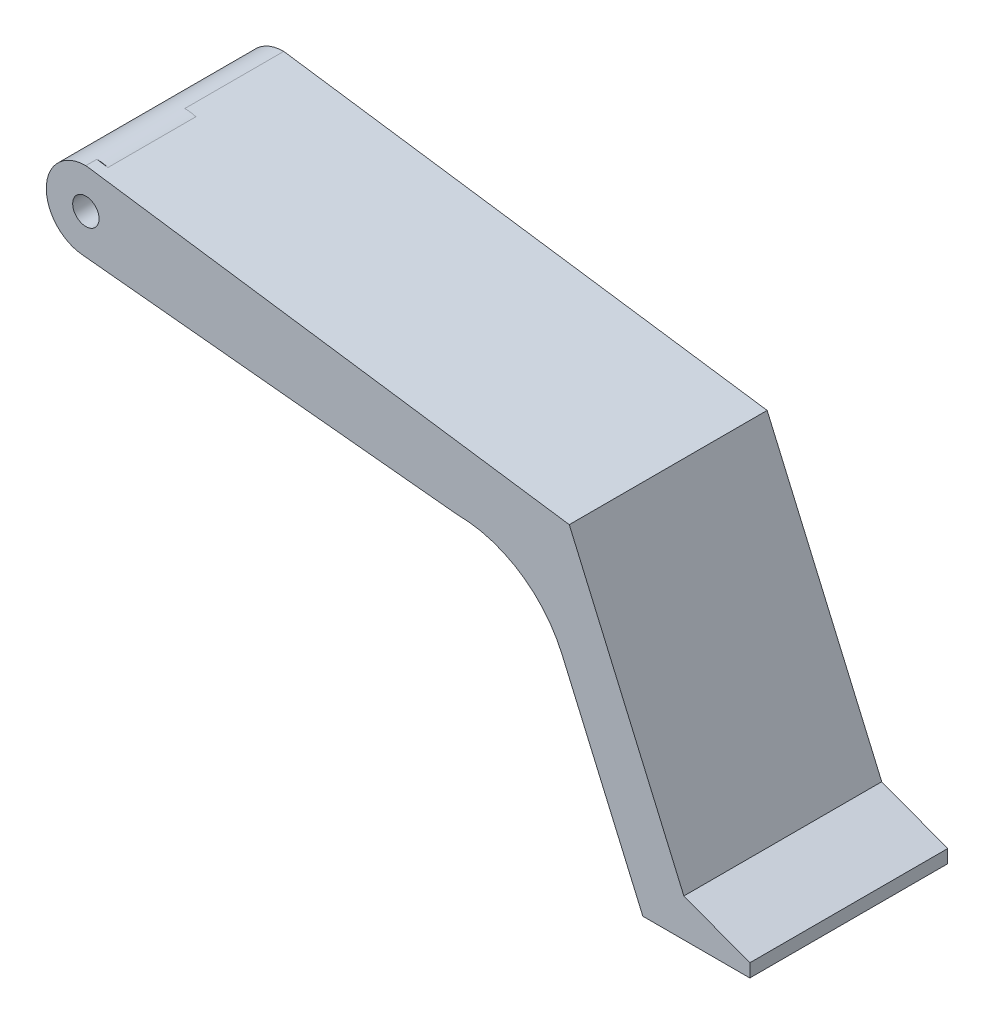
ISO-10303-21;
HEADER;
FILE_DESCRIPTION(('STEP AP214'),'2;1');
FILE_NAME('part.step','',(''),(''),'','','');
FILE_SCHEMA(('AUTOMOTIVE_DESIGN { 1 0 10303 214 1 1 1 1 }'));
ENDSEC;
DATA;
#1=APPLICATION_CONTEXT('core data for automotive mechanical design processes');
#2=APPLICATION_PROTOCOL_DEFINITION('international standard','automotive_design',2000,#1);
#3=PRODUCT_CONTEXT('',#1,'mechanical');
#4=PRODUCT('Part','Part','',(#3));
#5=PRODUCT_RELATED_PRODUCT_CATEGORY('part','',(#4));
#6=PRODUCT_DEFINITION_FORMATION('','',#4);
#7=PRODUCT_DEFINITION_CONTEXT('part definition',#1,'design');
#8=PRODUCT_DEFINITION('design','',#6,#7);
#9=PRODUCT_DEFINITION_SHAPE('','',#8);
#10=(LENGTH_UNIT() NAMED_UNIT(*) SI_UNIT(.MILLI.,.METRE.));
#11=(NAMED_UNIT(*) PLANE_ANGLE_UNIT() SI_UNIT($,.RADIAN.));
#12=(NAMED_UNIT(*) SI_UNIT($,.STERADIAN.) SOLID_ANGLE_UNIT());
#13=UNCERTAINTY_MEASURE_WITH_UNIT(LENGTH_MEASURE(1.E-05),#10,'distance_accuracy_value','');
#14=(GEOMETRIC_REPRESENTATION_CONTEXT(3) GLOBAL_UNCERTAINTY_ASSIGNED_CONTEXT((#13)) GLOBAL_UNIT_ASSIGNED_CONTEXT((#10,
#11,#12)) REPRESENTATION_CONTEXT('',''));
#15=CARTESIAN_POINT('',(0.,0.,0.));
#16=DIRECTION('',(0.,0.,1.));
#17=DIRECTION('',(1.,0.,0.));
#18=AXIS2_PLACEMENT_3D('',#15,#16,#17);
#19=CARTESIAN_POINT('',(6.58692087464744,65.7955825001185,22.5));
#20=DIRECTION('',(-0.0996139609090756,-0.995026159853099,0.));
#21=DIRECTION('',(0.995026159853099,-0.0996139609090756,0.));
#22=AXIS2_PLACEMENT_3D('',#19,#20,#21);
#23=PLANE('',#22);
#24=DIRECTION('',(0.,0.,-1.));
#25=VECTOR('',#24,1.);
#26=CARTESIAN_POINT('',(-0.896525648181682,66.5447645613221,22.5));
#27=LINE('',#26,#25);
#28=CARTESIAN_POINT('',(-0.896525648181682,66.5447645613221,22.5));
#29=VERTEX_POINT('',#28);
#30=CARTESIAN_POINT('',(-0.896525648181682,66.5447645613221,-22.5));
#31=VERTEX_POINT('',#30);
#32=EDGE_CURVE('E133',#29,#31,#27,.T.);
#33=ORIENTED_EDGE('',*,*,#32,.T.);
#34=DIRECTION('',(-0.995026159853099,0.0996139609090756,0.));
#35=VECTOR('',#34,1.);
#36=CARTESIAN_POINT('',(6.58692087464744,65.7955825001185,-22.5));
#37=LINE('',#36,#35);
#38=CARTESIAN_POINT('',(70.0381823969097,59.4433560562999,-22.5));
#39=VERTEX_POINT('',#38);
#40=EDGE_CURVE('E92',#39,#31,#37,.T.);
#41=ORIENTED_EDGE('',*,*,#40,.F.);
#42=DIRECTION('',(0.,0.,1.));
#43=VECTOR('',#42,1.);
#44=CARTESIAN_POINT('',(70.0381823969097,59.4433560562999,-40.));
#45=LINE('',#44,#43);
#46=CARTESIAN_POINT('',(70.0381823969097,59.4433560562999,2.));
#47=VERTEX_POINT('',#46);
#48=EDGE_CURVE('E63',#47,#39,#45,.F.);
#49=ORIENTED_EDGE('',*,*,#48,.F.);
#50=DIRECTION('',(-0.995026159853099,0.0996139609090756,0.));
#51=VECTOR('',#50,1.);
#52=CARTESIAN_POINT('',(6.58692087464744,65.7955825001185,2.));
#53=LINE('',#52,#51);
#54=CARTESIAN_POINT('',(84.4556096419889,58.,2.));
#55=VERTEX_POINT('',#54);
#56=EDGE_CURVE('E85',#55,#47,#53,.T.);
#57=ORIENTED_EDGE('',*,*,#56,.F.);
#58=DIRECTION('',(0.,0.,-1.));
#59=VECTOR('',#58,1.);
#60=CARTESIAN_POINT('',(84.4556096419889,58.,22.5));
#61=LINE('',#60,#59);
#62=CARTESIAN_POINT('',(84.4556096419889,58.,22.5));
#63=VERTEX_POINT('',#62);
#64=EDGE_CURVE('E181',#63,#55,#61,.T.);
#65=ORIENTED_EDGE('',*,*,#64,.F.);
#66=DIRECTION('',(-0.995026159853099,0.0996139609090756,0.));
#67=VECTOR('',#66,1.);
#68=CARTESIAN_POINT('',(6.58692087464744,65.7955825001185,22.5));
#69=LINE('',#68,#67);
#70=EDGE_CURVE('E102',#63,#29,#69,.T.);
#71=ORIENTED_EDGE('',*,*,#70,.T.);
#72=EDGE_LOOP('',(#33,#41,#49,#57,#65,#71));
#73=FACE_BOUND('',#72,.T.);
#74=ADVANCED_FACE('F45',(#73),#23,.T.);
#75=CARTESIAN_POINT('',(84.4556096419889,32.,22.5));
#76=DIRECTION('',(0.,0.,-1.));
#77=DIRECTION('',(-1.,0.,0.));
#78=AXIS2_PLACEMENT_3D('',#75,#76,#77);
#79=CYLINDRICAL_SURFACE('',#78,26.);
#80=ORIENTED_EDGE('',*,*,#64,.T.);
#81=CARTESIAN_POINT('',(84.4556096419889,32.,2.));
#82=DIRECTION('',(0.,0.,1.));
#83=DIRECTION('',(1.,0.,0.));
#84=AXIS2_PLACEMENT_3D('',#81,#82,#83);
#85=CIRCLE('',#84,26.);
#86=CARTESIAN_POINT('',(108.309930194906,42.3426974701319,2.));
#87=VERTEX_POINT('',#86);
#88=EDGE_CURVE('E88',#55,#87,#85,.F.);
#89=ORIENTED_EDGE('',*,*,#88,.T.);
#90=DIRECTION('',(0.,0.,-1.));
#91=VECTOR('',#90,1.);
#92=CARTESIAN_POINT('',(108.309930194906,42.3426974701319,22.5));
#93=LINE('',#92,#91);
#94=CARTESIAN_POINT('',(108.309930194906,42.3426974701319,22.5));
#95=VERTEX_POINT('',#94);
#96=EDGE_CURVE('E178',#95,#87,#93,.T.);
#97=ORIENTED_EDGE('',*,*,#96,.F.);
#98=CARTESIAN_POINT('',(84.4556096419889,32.,22.5));
#99=DIRECTION('',(0.,0.,1.));
#100=DIRECTION('',(1.,0.,0.));
#101=AXIS2_PLACEMENT_3D('',#98,#99,#100);
#102=CIRCLE('',#101,26.);
#103=EDGE_CURVE('E105',#63,#95,#102,.F.);
#104=ORIENTED_EDGE('',*,*,#103,.F.);
#105=EDGE_LOOP('',(#80,#89,#97,#104));
#106=FACE_BOUND('',#105,.T.);
#107=ADVANCED_FACE('F209',(#106),#79,.F.);
#108=CARTESIAN_POINT('',(106.624490297027,46.2299835202938,22.5));
#109=DIRECTION('',(-0.917473867419891,-0.397796056543537,0.));
#110=DIRECTION('',(0.397796056543537,-0.917473867419891,0.));
#111=AXIS2_PLACEMENT_3D('',#108,#109,#110);
#112=PLANE('',#111);
#113=DIRECTION('',(0.,0.,1.));
#114=VECTOR('',#113,1.);
#115=CARTESIAN_POINT('',(115.025500553517,26.8539559215571,-40.));
#116=LINE('',#115,#114);
#117=CARTESIAN_POINT('',(115.025500553517,26.8539559215571,-22.5));
#118=VERTEX_POINT('',#117);
#119=CARTESIAN_POINT('',(115.025500553517,26.8539559215571,2.));
#120=VERTEX_POINT('',#119);
#121=EDGE_CURVE('E79',#118,#120,#116,.T.);
#122=ORIENTED_EDGE('',*,*,#121,.F.);
#123=DIRECTION('',(-0.397796056543537,0.917473867419891,0.));
#124=VECTOR('',#123,1.);
#125=CARTESIAN_POINT('',(106.624490297027,46.2299835202938,-22.5));
#126=LINE('',#125,#124);
#127=CARTESIAN_POINT('',(126.668772528348,4.90725082097354E-11,-22.5));
#128=VERTEX_POINT('',#127);
#129=EDGE_CURVE('E135',#128,#118,#126,.T.);
#130=ORIENTED_EDGE('',*,*,#129,.F.);
#131=DIRECTION('',(0.,0.,-1.));
#132=VECTOR('',#131,1.);
#133=CARTESIAN_POINT('',(126.668772528348,4.90725082097354E-11,22.5));
#134=LINE('',#133,#132);
#135=CARTESIAN_POINT('',(126.668772528348,4.90725082097354E-11,22.5));
#136=VERTEX_POINT('',#135);
#137=EDGE_CURVE('E175',#136,#128,#134,.T.);
#138=ORIENTED_EDGE('',*,*,#137,.F.);
#139=DIRECTION('',(-0.397796056543537,0.917473867419891,0.));
#140=VECTOR('',#139,1.);
#141=CARTESIAN_POINT('',(106.624490297027,46.2299835202938,22.5));
#142=LINE('',#141,#140);
#143=EDGE_CURVE('E109',#136,#95,#142,.T.);
#144=ORIENTED_EDGE('',*,*,#143,.T.);
#145=ORIENTED_EDGE('',*,*,#96,.T.);
#146=DIRECTION('',(-0.397796056543537,0.917473867419891,0.));
#147=VECTOR('',#146,1.);
#148=CARTESIAN_POINT('',(106.624490297027,46.2299835202938,2.));
#149=LINE('',#148,#147);
#150=EDGE_CURVE('E11',#120,#87,#149,.T.);
#151=ORIENTED_EDGE('',*,*,#150,.F.);
#152=EDGE_LOOP('',(#122,#130,#138,#144,#145,#151));
#153=FACE_BOUND('',#152,.T.);
#154=ADVANCED_FACE('F205',(#153),#112,.T.);
#155=CARTESIAN_POINT('',(0.,4.90623469528793E-11,22.5));
#156=DIRECTION('',(0.,-1.,0.));
#157=DIRECTION('',(1.,0.,0.));
#158=AXIS2_PLACEMENT_3D('',#155,#156,#157);
#159=PLANE('',#158);
#160=DIRECTION('',(-1.,0.,0.));
#161=VECTOR('',#160,1.);
#162=CARTESIAN_POINT('',(0.,4.90623469528793E-11,-22.5));
#163=LINE('',#162,#161);
#164=CARTESIAN_POINT('',(150.996688705439,4.90744597736459E-11,-22.5));
#165=VERTEX_POINT('',#164);
#166=EDGE_CURVE('E138',#165,#128,#163,.T.);
#167=ORIENTED_EDGE('',*,*,#166,.F.);
#168=DIRECTION('',(0.,0.,-1.));
#169=VECTOR('',#168,1.);
#170=CARTESIAN_POINT('',(150.996688705439,4.90744597736459E-11,22.5));
#171=LINE('',#170,#169);
#172=CARTESIAN_POINT('',(150.996688705439,4.90744597736459E-11,22.5));
#173=VERTEX_POINT('',#172);
#174=EDGE_CURVE('E172',#173,#165,#171,.T.);
#175=ORIENTED_EDGE('',*,*,#174,.F.);
#176=DIRECTION('',(-1.,0.,0.));
#177=VECTOR('',#176,1.);
#178=CARTESIAN_POINT('',(0.,4.90623469528793E-11,22.5));
#179=LINE('',#178,#177);
#180=EDGE_CURVE('E112',#173,#136,#179,.T.);
#181=ORIENTED_EDGE('',*,*,#180,.T.);
#182=ORIENTED_EDGE('',*,*,#137,.T.);
#183=EDGE_LOOP('',(#167,#175,#181,#182));
#184=FACE_BOUND('',#183,.T.);
#185=ADVANCED_FACE('F289',(#184),#159,.T.);
#186=CARTESIAN_POINT('',(150.996688705439,0.,22.5));
#187=DIRECTION('',(1.,0.,0.));
#188=DIRECTION('',(0.,0.,-1.));
#189=AXIS2_PLACEMENT_3D('',#186,#187,#188);
#190=PLANE('',#189);
#191=DIRECTION('',(0.,-1.,0.));
#192=VECTOR('',#191,1.);
#193=CARTESIAN_POINT('',(150.996688705439,0.,-22.5));
#194=LINE('',#193,#192);
#195=CARTESIAN_POINT('',(150.996688705439,3.00000000004907,-22.5));
#196=VERTEX_POINT('',#195);
#197=EDGE_CURVE('E141',#196,#165,#194,.T.);
#198=ORIENTED_EDGE('',*,*,#197,.F.);
#199=DIRECTION('',(0.,0.,-1.));
#200=VECTOR('',#199,1.);
#201=CARTESIAN_POINT('',(150.996688705439,3.00000000004907,22.5));
#202=LINE('',#201,#200);
#203=CARTESIAN_POINT('',(150.996688705439,3.00000000004907,22.5));
#204=VERTEX_POINT('',#203);
#205=EDGE_CURVE('E169',#204,#196,#202,.T.);
#206=ORIENTED_EDGE('',*,*,#205,.F.);
#207=DIRECTION('',(0.,-1.,0.));
#208=VECTOR('',#207,1.);
#209=CARTESIAN_POINT('',(150.996688705439,0.,22.5));
#210=LINE('',#209,#208);
#211=EDGE_CURVE('E115',#204,#173,#210,.T.);
#212=ORIENTED_EDGE('',*,*,#211,.T.);
#213=ORIENTED_EDGE('',*,*,#174,.T.);
#214=EDGE_LOOP('',(#198,#206,#212,#213));
#215=FACE_BOUND('',#214,.T.);
#216=ADVANCED_FACE('F292',(#215),#190,.T.);
#217=CARTESIAN_POINT('',(19.7649929447935,52.4513840915535,22.5));
#218=DIRECTION('',(0.352620221224145,0.935766519802795,0.));
#219=DIRECTION('',(-0.935766519802795,0.352620221224145,0.));
#220=AXIS2_PLACEMENT_3D('',#217,#218,#219);
#221=PLANE('',#220);
#222=DIRECTION('',(0.935766519802795,-0.352620221224145,0.));
#223=VECTOR('',#222,1.);
#224=CARTESIAN_POINT('',(19.7649929447935,52.4513840915535,-22.5));
#225=LINE('',#224,#223);
#226=CARTESIAN_POINT('',(135.996688705439,8.6523750385115,-22.5));
#227=VERTEX_POINT('',#226);
#228=EDGE_CURVE('E144',#227,#196,#225,.T.);
#229=ORIENTED_EDGE('',*,*,#228,.F.);
#230=DIRECTION('',(0.,0.,-1.));
#231=VECTOR('',#230,1.);
#232=CARTESIAN_POINT('',(135.996688705439,8.6523750385115,22.5));
#233=LINE('',#232,#231);
#234=CARTESIAN_POINT('',(135.996688705439,8.6523750385115,22.5));
#235=VERTEX_POINT('',#234);
#236=EDGE_CURVE('E166',#235,#227,#233,.T.);
#237=ORIENTED_EDGE('',*,*,#236,.F.);
#238=DIRECTION('',(0.935766519802795,-0.352620221224145,0.));
#239=VECTOR('',#238,1.);
#240=CARTESIAN_POINT('',(19.7649929447935,52.4513840915535,22.5));
#241=LINE('',#240,#239);
#242=EDGE_CURVE('E118',#235,#204,#241,.T.);
#243=ORIENTED_EDGE('',*,*,#242,.T.);
#244=ORIENTED_EDGE('',*,*,#205,.T.);
#245=EDGE_LOOP('',(#229,#237,#243,#244));
#246=FACE_BOUND('',#245,.T.);
#247=ADVANCED_FACE('F296',(#246),#221,.T.);
#248=CARTESIAN_POINT('',(117.634176706065,51.0035361988163,22.5));
#249=DIRECTION('',(0.91747386741989,0.397796056543537,0.));
#250=DIRECTION('',(-0.397796056543537,0.917473867419891,0.));
#251=AXIS2_PLACEMENT_3D('',#248,#249,#250);
#252=PLANE('',#251);
#253=DIRECTION('',(0.397796056543537,-0.917473867419891,0.));
#254=VECTOR('',#253,1.);
#255=CARTESIAN_POINT('',(117.634176706065,51.0035361988163,-22.5));
#256=LINE('',#255,#254);
#257=CARTESIAN_POINT('',(109.935465309096,68.7597869291548,-22.5));
#258=VERTEX_POINT('',#257);
#259=EDGE_CURVE('E147',#258,#227,#256,.T.);
#260=ORIENTED_EDGE('',*,*,#259,.F.);
#261=DIRECTION('',(0.,0.,-1.));
#262=VECTOR('',#261,1.);
#263=CARTESIAN_POINT('',(109.935465309096,68.7597869291548,22.5));
#264=LINE('',#263,#262);
#265=CARTESIAN_POINT('',(109.935465309096,68.7597869291548,22.5));
#266=VERTEX_POINT('',#265);
#267=EDGE_CURVE('E163',#266,#258,#264,.T.);
#268=ORIENTED_EDGE('',*,*,#267,.F.);
#269=DIRECTION('',(0.397796056543537,-0.917473867419891,0.));
#270=VECTOR('',#269,1.);
#271=CARTESIAN_POINT('',(117.634176706065,51.0035361988163,22.5));
#272=LINE('',#271,#270);
#273=EDGE_CURVE('E121',#266,#235,#272,.T.);
#274=ORIENTED_EDGE('',*,*,#273,.T.);
#275=ORIENTED_EDGE('',*,*,#236,.T.);
#276=EDGE_LOOP('',(#260,#268,#274,#275));
#277=FACE_BOUND('',#276,.T.);
#278=ADVANCED_FACE('F300',(#277),#252,.T.);
#279=CARTESIAN_POINT('',(11.8554120866336,82.8025795018776,22.5));
#280=DIRECTION('',(0.141731494544535,0.989905138613884,0.));
#281=DIRECTION('',(-0.989905138613884,0.141731494544535,0.));
#282=AXIS2_PLACEMENT_3D('',#279,#280,#281);
#283=PLANE('',#282);
#284=DIRECTION('',(0.,0.,-1.));
#285=VECTOR('',#284,1.);
#286=CARTESIAN_POINT('',(2.52541322555497,84.1384193021752,20.));
#287=LINE('',#286,#285);
#288=CARTESIAN_POINT('',(2.52541322555497,84.1384193021752,20.));
#289=VERTEX_POINT('',#288);
#290=CARTESIAN_POINT('',(2.52541322555499,84.1384193021752,0.));
#291=VERTEX_POINT('',#290);
#292=EDGE_CURVE('E183',#289,#291,#287,.T.);
#293=ORIENTED_EDGE('',*,*,#292,.F.);
#294=DIRECTION('',(-0.989905138613884,0.141731494544535,0.));
#295=VECTOR('',#294,1.);
#296=CARTESIAN_POINT('',(11.8554120866336,82.8025795018776,20.));
#297=LINE('',#296,#295);
#298=CARTESIAN_POINT('',(0.,84.5,20.));
#299=VERTEX_POINT('',#298);
#300=EDGE_CURVE('E186',#289,#299,#297,.T.);
#301=ORIENTED_EDGE('',*,*,#300,.T.);
#302=DIRECTION('',(0.,0.,-1.));
#303=VECTOR('',#302,1.);
#304=CARTESIAN_POINT('',(0.,84.5,22.5));
#305=LINE('',#304,#303);
#306=CARTESIAN_POINT('',(0.,84.5,22.5));
#307=VERTEX_POINT('',#306);
#308=EDGE_CURVE('E160',#307,#299,#305,.T.);
#309=ORIENTED_EDGE('',*,*,#308,.F.);
#310=DIRECTION('',(0.989905138613884,-0.141731494544535,0.));
#311=VECTOR('',#310,1.);
#312=CARTESIAN_POINT('',(11.8554120866336,82.8025795018776,22.5));
#313=LINE('',#312,#311);
#314=EDGE_CURVE('E124',#307,#266,#313,.T.);
#315=ORIENTED_EDGE('',*,*,#314,.T.);
#316=ORIENTED_EDGE('',*,*,#267,.T.);
#317=DIRECTION('',(0.989905138613884,-0.141731494544535,0.));
#318=VECTOR('',#317,1.);
#319=CARTESIAN_POINT('',(11.8554120866336,82.8025795018776,-22.5));
#320=LINE('',#319,#318);
#321=CARTESIAN_POINT('',(0.,84.5,-22.5));
#322=VERTEX_POINT('',#321);
#323=EDGE_CURVE('E150',#322,#258,#320,.T.);
#324=ORIENTED_EDGE('',*,*,#323,.F.);
#325=CARTESIAN_POINT('',(0.,84.5,0.));
#326=VERTEX_POINT('',#325);
#327=EDGE_CURVE('E159',#326,#322,#305,.T.);
#328=ORIENTED_EDGE('',*,*,#327,.F.);
#329=DIRECTION('',(-0.989905138613884,0.141731494544535,0.));
#330=VECTOR('',#329,1.);
#331=CARTESIAN_POINT('',(11.8554120866336,82.8025795018776,0.));
#332=LINE('',#331,#330);
#333=EDGE_CURVE('E193',#291,#326,#332,.T.);
#334=ORIENTED_EDGE('',*,*,#333,.F.);
#335=EDGE_LOOP('',(#293,#301,#309,#315,#316,#324,#328,#334));
#336=FACE_BOUND('',#335,.T.);
#337=ADVANCED_FACE('F255',(#336),#283,.T.);
#338=CARTESIAN_POINT('',(0.,0.,22.5));
#339=DIRECTION('',(0.,0.,1.));
#340=DIRECTION('',(1.,0.,0.));
#341=AXIS2_PLACEMENT_3D('',#338,#339,#340);
#342=PLANE('',#341);
#343=ORIENTED_EDGE('',*,*,#70,.F.);
#344=ORIENTED_EDGE('',*,*,#103,.T.);
#345=ORIENTED_EDGE('',*,*,#143,.F.);
#346=ORIENTED_EDGE('',*,*,#180,.F.);
#347=ORIENTED_EDGE('',*,*,#211,.F.);
#348=ORIENTED_EDGE('',*,*,#242,.F.);
#349=ORIENTED_EDGE('',*,*,#273,.F.);
#350=ORIENTED_EDGE('',*,*,#314,.F.);
#351=CARTESIAN_POINT('',(0.,75.5,22.5));
#352=DIRECTION('',(0.,0.,1.));
#353=DIRECTION('',(1.,0.,0.));
#354=AXIS2_PLACEMENT_3D('',#351,#352,#353);
#355=CIRCLE('',#354,9.00000000000001);
#356=EDGE_CURVE('E127',#307,#29,#355,.T.);
#357=ORIENTED_EDGE('',*,*,#356,.T.);
#358=EDGE_LOOP('',(#343,#344,#345,#346,#347,#348,#349,#350,#357));
#359=FACE_BOUND('',#358,.T.);
#360=CARTESIAN_POINT('',(0.,75.5,22.5));
#361=DIRECTION('',(0.,0.,1.));
#362=DIRECTION('',(1.,0.,0.));
#363=AXIS2_PLACEMENT_3D('',#360,#361,#362);
#364=CIRCLE('',#363,3.);
#365=CARTESIAN_POINT('',(3.,75.5,22.5));
#366=VERTEX_POINT('',#365);
#367=EDGE_CURVE('E130',#366,#366,#364,.T.);
#368=ORIENTED_EDGE('',*,*,#367,.F.);
#369=EDGE_LOOP('',(#368));
#370=FACE_BOUND('',#369,.T.);
#371=ADVANCED_FACE('F307',(#359,#370),#342,.T.);
#372=CARTESIAN_POINT('',(0.,0.,-22.5));
#373=DIRECTION('',(0.,0.,1.));
#374=DIRECTION('',(1.,0.,0.));
#375=AXIS2_PLACEMENT_3D('',#372,#373,#374);
#376=PLANE('',#375);
#377=ORIENTED_EDGE('',*,*,#129,.T.);
#378=CARTESIAN_POINT('',(84.4556096419889,32.,-22.5));
#379=DIRECTION('',(0.,0.,1.));
#380=DIRECTION('',(1.,0.,0.));
#381=AXIS2_PLACEMENT_3D('',#378,#379,#380);
#382=CIRCLE('',#381,31.);
#383=EDGE_CURVE('E55',#118,#39,#382,.T.);
#384=ORIENTED_EDGE('',*,*,#383,.T.);
#385=ORIENTED_EDGE('',*,*,#40,.T.);
#386=CARTESIAN_POINT('',(0.,75.5,-22.5));
#387=DIRECTION('',(0.,0.,1.));
#388=DIRECTION('',(1.,0.,0.));
#389=AXIS2_PLACEMENT_3D('',#386,#387,#388);
#390=CIRCLE('',#389,9.00000000000001);
#391=EDGE_CURVE('E153',#322,#31,#390,.T.);
#392=ORIENTED_EDGE('',*,*,#391,.F.);
#393=ORIENTED_EDGE('',*,*,#323,.T.);
#394=ORIENTED_EDGE('',*,*,#259,.T.);
#395=ORIENTED_EDGE('',*,*,#228,.T.);
#396=ORIENTED_EDGE('',*,*,#197,.T.);
#397=ORIENTED_EDGE('',*,*,#166,.T.);
#398=EDGE_LOOP('',(#377,#384,#385,#392,#393,#394,#395,#396,#397));
#399=FACE_BOUND('',#398,.T.);
#400=CARTESIAN_POINT('',(0.,75.5,-22.5));
#401=DIRECTION('',(0.,0.,1.));
#402=DIRECTION('',(1.,0.,0.));
#403=AXIS2_PLACEMENT_3D('',#400,#401,#402);
#404=CIRCLE('',#403,3.);
#405=CARTESIAN_POINT('',(3.,75.5,-22.5));
#406=VERTEX_POINT('',#405);
#407=EDGE_CURVE('E106',#406,#406,#404,.T.);
#408=ORIENTED_EDGE('',*,*,#407,.T.);
#409=EDGE_LOOP('',(#408));
#410=FACE_BOUND('',#409,.T.);
#411=ADVANCED_FACE('F199',(#399,#410),#376,.F.);
#412=CARTESIAN_POINT('',(0.,75.5,20.));
#413=DIRECTION('',(0.,0.,-1.));
#414=DIRECTION('',(-1.,0.,0.));
#415=AXIS2_PLACEMENT_3D('',#412,#413,#414);
#416=CYLINDRICAL_SURFACE('',#415,3.);
#417=ORIENTED_EDGE('',*,*,#407,.F.);
#418=EDGE_LOOP('',(#417));
#419=FACE_BOUND('',#418,.T.);
#420=ORIENTED_EDGE('',*,*,#367,.T.);
#421=EDGE_LOOP('',(#420));
#422=FACE_BOUND('',#421,.T.);
#423=ADVANCED_FACE('F266',(#419,#422),#416,.F.);
#424=CARTESIAN_POINT('',(0.,0.,0.));
#425=DIRECTION('',(0.,0.,1.));
#426=DIRECTION('',(1.,0.,0.));
#427=AXIS2_PLACEMENT_3D('',#424,#425,#426);
#428=PLANE('',#427);
#429=CARTESIAN_POINT('',(0.,75.5,0.));
#430=DIRECTION('',(0.,0.,1.));
#431=DIRECTION('',(1.,0.,0.));
#432=AXIS2_PLACEMENT_3D('',#429,#430,#431);
#433=CIRCLE('',#432,9.00000000000001);
#434=EDGE_CURVE('E189',#291,#326,#433,.T.);
#435=ORIENTED_EDGE('',*,*,#434,.F.);
#436=ORIENTED_EDGE('',*,*,#333,.T.);
#437=EDGE_LOOP('',(#435,#436));
#438=FACE_BOUND('',#437,.T.);
#439=ADVANCED_FACE('F263',(#438),#428,.F.);
#440=CARTESIAN_POINT('',(0.,0.,20.));
#441=DIRECTION('',(0.,0.,1.));
#442=DIRECTION('',(1.,0.,0.));
#443=AXIS2_PLACEMENT_3D('',#440,#441,#442);
#444=PLANE('',#443);
#445=ORIENTED_EDGE('',*,*,#300,.F.);
#446=CARTESIAN_POINT('',(0.,75.5,20.));
#447=DIRECTION('',(0.,0.,1.));
#448=DIRECTION('',(1.,0.,0.));
#449=AXIS2_PLACEMENT_3D('',#446,#447,#448);
#450=CIRCLE('',#449,9.00000000000001);
#451=EDGE_CURVE('E190',#289,#299,#450,.T.);
#452=ORIENTED_EDGE('',*,*,#451,.T.);
#453=EDGE_LOOP('',(#445,#452));
#454=FACE_BOUND('',#453,.T.);
#455=ADVANCED_FACE('F265',(#454),#444,.T.);
#456=CARTESIAN_POINT('',(0.,75.5,20.));
#457=DIRECTION('',(0.,0.,-1.));
#458=DIRECTION('',(-1.,0.,0.));
#459=AXIS2_PLACEMENT_3D('',#456,#457,#458);
#460=CYLINDRICAL_SURFACE('',#459,9.00000000000001);
#461=ORIENTED_EDGE('',*,*,#451,.F.);
#462=ORIENTED_EDGE('',*,*,#292,.T.);
#463=ORIENTED_EDGE('',*,*,#434,.T.);
#464=ORIENTED_EDGE('',*,*,#327,.T.);
#465=ORIENTED_EDGE('',*,*,#391,.T.);
#466=ORIENTED_EDGE('',*,*,#32,.F.);
#467=ORIENTED_EDGE('',*,*,#356,.F.);
#468=ORIENTED_EDGE('',*,*,#308,.T.);
#469=EDGE_LOOP('',(#461,#462,#463,#464,#465,#466,#467,#468));
#470=FACE_BOUND('',#469,.T.);
#471=ADVANCED_FACE('F262',(#470),#460,.T.);
#472=CARTESIAN_POINT('',(84.4556096419889,32.,-40.));
#473=DIRECTION('',(0.,0.,1.));
#474=DIRECTION('',(1.,0.,0.));
#475=AXIS2_PLACEMENT_3D('',#472,#473,#474);
#476=CYLINDRICAL_SURFACE('',#475,31.);
#477=ORIENTED_EDGE('',*,*,#48,.T.);
#478=ORIENTED_EDGE('',*,*,#383,.F.);
#479=ORIENTED_EDGE('',*,*,#121,.T.);
#480=CARTESIAN_POINT('',(84.4556096419889,32.,2.));
#481=DIRECTION('',(0.,0.,1.));
#482=DIRECTION('',(1.,0.,0.));
#483=AXIS2_PLACEMENT_3D('',#480,#481,#482);
#484=CIRCLE('',#483,31.);
#485=EDGE_CURVE('E49',#120,#47,#484,.T.);
#486=ORIENTED_EDGE('',*,*,#485,.T.);
#487=EDGE_LOOP('',(#477,#478,#479,#486));
#488=FACE_BOUND('',#487,.T.);
#489=ADVANCED_FACE('F94',(#488),#476,.F.);
#490=CARTESIAN_POINT('',(84.4556096419889,32.,2.));
#491=DIRECTION('',(0.,0.,1.));
#492=DIRECTION('',(1.,0.,0.));
#493=AXIS2_PLACEMENT_3D('',#490,#491,#492);
#494=PLANE('',#493);
#495=ORIENTED_EDGE('',*,*,#56,.T.);
#496=ORIENTED_EDGE('',*,*,#485,.F.);
#497=ORIENTED_EDGE('',*,*,#150,.T.);
#498=ORIENTED_EDGE('',*,*,#88,.F.);
#499=EDGE_LOOP('',(#495,#496,#497,#498));
#500=FACE_BOUND('',#499,.T.);
#501=ADVANCED_FACE('F47',(#500),#494,.F.);
#502=CLOSED_SHELL('',(#74,#107,#154,#185,#216,#247,#278,#337,#371,#411,#423,#439,#455,#471,#489,#501));
#503=MANIFOLD_SOLID_BREP('B2',#502);
#504=ADVANCED_BREP_SHAPE_REPRESENTATION('',(#18,#503),#14);
#505=SHAPE_DEFINITION_REPRESENTATION(#9,#504);
ENDSEC;
END-ISO-10303-21;
